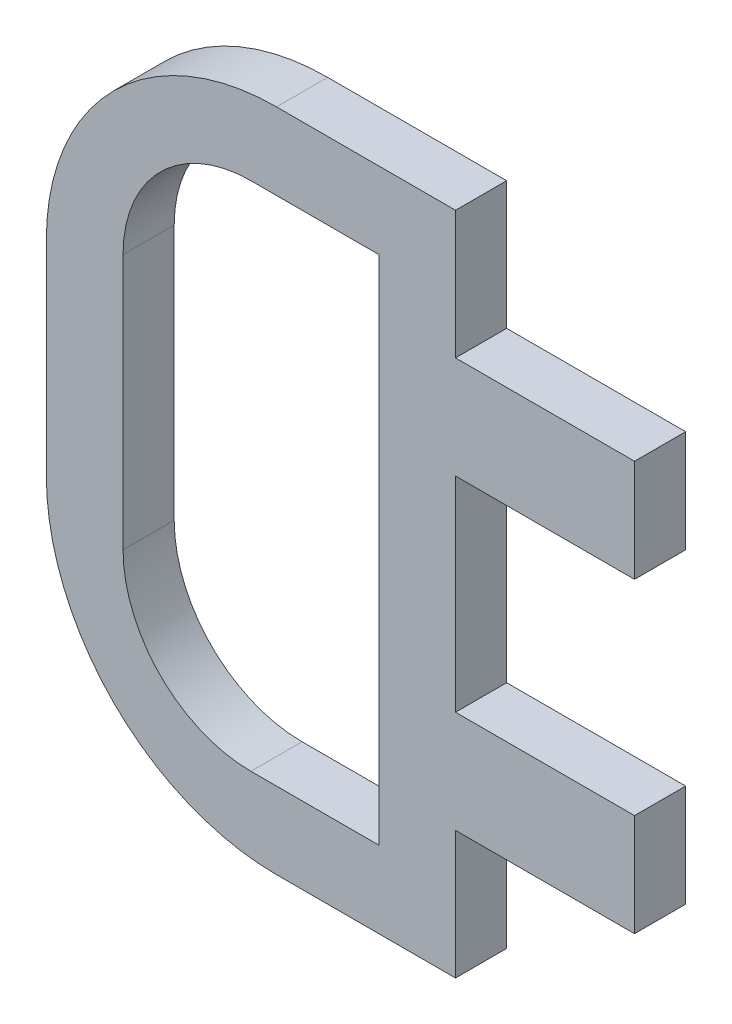
ISO-10303-21;
HEADER;
FILE_DESCRIPTION(('STEP AP214'),'2;1');
FILE_NAME('part.step','',(''),(''),'','','');
FILE_SCHEMA(('AUTOMOTIVE_DESIGN { 1 0 10303 214 1 1 1 1 }'));
ENDSEC;
DATA;
#1=APPLICATION_CONTEXT('core data for automotive mechanical design processes');
#2=APPLICATION_PROTOCOL_DEFINITION('international standard','automotive_design',2000,#1);
#3=PRODUCT_CONTEXT('',#1,'mechanical');
#4=PRODUCT('Part','Part','',(#3));
#5=PRODUCT_RELATED_PRODUCT_CATEGORY('part','',(#4));
#6=PRODUCT_DEFINITION_FORMATION('','',#4);
#7=PRODUCT_DEFINITION_CONTEXT('part definition',#1,'design');
#8=PRODUCT_DEFINITION('design','',#6,#7);
#9=PRODUCT_DEFINITION_SHAPE('','',#8);
#10=(LENGTH_UNIT() NAMED_UNIT(*) SI_UNIT(.MILLI.,.METRE.));
#11=(NAMED_UNIT(*) PLANE_ANGLE_UNIT() SI_UNIT($,.RADIAN.));
#12=(NAMED_UNIT(*) SI_UNIT($,.STERADIAN.) SOLID_ANGLE_UNIT());
#13=UNCERTAINTY_MEASURE_WITH_UNIT(LENGTH_MEASURE(1.E-05),#10,'distance_accuracy_value','');
#14=(GEOMETRIC_REPRESENTATION_CONTEXT(3) GLOBAL_UNCERTAINTY_ASSIGNED_CONTEXT((#13)) GLOBAL_UNIT_ASSIGNED_CONTEXT((#10,
#11,#12)) REPRESENTATION_CONTEXT('',''));
#15=CARTESIAN_POINT('',(0.,0.,0.));
#16=DIRECTION('',(0.,0.,1.));
#17=DIRECTION('',(1.,0.,0.));
#18=AXIS2_PLACEMENT_3D('',#15,#16,#17);
#19=CARTESIAN_POINT('',(40.,65.,10.));
#20=DIRECTION('',(-1.,0.,0.));
#21=DIRECTION('',(0.,-1.,0.));
#22=AXIS2_PLACEMENT_3D('',#19,#20,#21);
#23=PLANE('',#22);
#24=DIRECTION('',(0.,1.,0.));
#25=VECTOR('',#24,1.);
#26=CARTESIAN_POINT('',(40.,65.,10.));
#27=LINE('',#26,#25);
#28=CARTESIAN_POINT('',(40.,-20.,10.));
#29=VERTEX_POINT('',#28);
#30=CARTESIAN_POINT('',(40.,20.,10.));
#31=VERTEX_POINT('',#30);
#32=EDGE_CURVE('E39',#29,#31,#27,.T.);
#33=ORIENTED_EDGE('',*,*,#32,.F.);
#34=DIRECTION('',(0.,0.,1.));
#35=VECTOR('',#34,1.);
#36=CARTESIAN_POINT('',(40.,-20.,0.));
#37=LINE('',#36,#35);
#38=CARTESIAN_POINT('',(40.,-20.,0.));
#39=VERTEX_POINT('',#38);
#40=EDGE_CURVE('E268',#39,#29,#37,.T.);
#41=ORIENTED_EDGE('',*,*,#40,.F.);
#42=DIRECTION('',(0.,1.,0.));
#43=VECTOR('',#42,1.);
#44=CARTESIAN_POINT('',(40.,65.,0.));
#45=LINE('',#44,#43);
#46=CARTESIAN_POINT('',(40.,20.,0.));
#47=VERTEX_POINT('',#46);
#48=EDGE_CURVE('E203',#39,#47,#45,.T.);
#49=ORIENTED_EDGE('',*,*,#48,.T.);
#50=DIRECTION('',(0.,0.,1.));
#51=VECTOR('',#50,1.);
#52=CARTESIAN_POINT('',(40.,20.,0.));
#53=LINE('',#52,#51);
#54=EDGE_CURVE('E231',#47,#31,#53,.T.);
#55=ORIENTED_EDGE('',*,*,#54,.T.);
#56=EDGE_LOOP('',(#33,#41,#49,#55));
#57=FACE_BOUND('',#56,.T.);
#58=ADVANCED_FACE('F35',(#57),#23,.F.);
#59=DIRECTION('',(0.,0.,1.));
#60=VECTOR('',#59,1.);
#61=CARTESIAN_POINT('',(40.,40.,0.));
#62=LINE('',#61,#60);
#63=CARTESIAN_POINT('',(40.,40.,0.));
#64=VERTEX_POINT('',#63);
#65=CARTESIAN_POINT('',(40.,40.,10.));
#66=VERTEX_POINT('',#65);
#67=EDGE_CURVE('E233',#64,#66,#62,.T.);
#68=ORIENTED_EDGE('',*,*,#67,.F.);
#69=CARTESIAN_POINT('',(40.,65.,0.));
#70=VERTEX_POINT('',#69);
#71=EDGE_CURVE('E207',#64,#70,#45,.T.);
#72=ORIENTED_EDGE('',*,*,#71,.T.);
#73=DIRECTION('',(0.,0.,-1.));
#74=VECTOR('',#73,1.);
#75=CARTESIAN_POINT('',(40.,65.,10.));
#76=LINE('',#75,#74);
#77=CARTESIAN_POINT('',(40.,65.,10.));
#78=VERTEX_POINT('',#77);
#79=EDGE_CURVE('E11',#78,#70,#76,.T.);
#80=ORIENTED_EDGE('',*,*,#79,.F.);
#81=EDGE_CURVE('E285',#66,#78,#27,.T.);
#82=ORIENTED_EDGE('',*,*,#81,.F.);
#83=EDGE_LOOP('',(#68,#72,#80,#82));
#84=FACE_BOUND('',#83,.T.);
#85=ADVANCED_FACE('F341',(#84),#23,.F.);
#86=CARTESIAN_POINT('',(5.,-20.,10.));
#87=DIRECTION('',(0.,0.,1.));
#88=DIRECTION('',(1.,0.,0.));
#89=AXIS2_PLACEMENT_3D('',#86,#87,#88);
#90=PLANE('',#89);
#91=CARTESIAN_POINT('',(40.,-65.,10.));
#92=VERTEX_POINT('',#91);
#93=CARTESIAN_POINT('',(40.,-40.,10.));
#94=VERTEX_POINT('',#93);
#95=EDGE_CURVE('E284',#92,#94,#27,.T.);
#96=ORIENTED_EDGE('',*,*,#95,.T.);
#97=DIRECTION('',(1.,0.,0.));
#98=VECTOR('',#97,1.);
#99=CARTESIAN_POINT('',(40.,-40.,10.));
#100=LINE('',#99,#98);
#101=CARTESIAN_POINT('',(75.,-40.,10.));
#102=VERTEX_POINT('',#101);
#103=EDGE_CURVE('E180',#94,#102,#100,.T.);
#104=ORIENTED_EDGE('',*,*,#103,.T.);
#105=DIRECTION('',(0.,1.,0.));
#106=VECTOR('',#105,1.);
#107=CARTESIAN_POINT('',(75.,-20.,10.));
#108=LINE('',#107,#106);
#109=CARTESIAN_POINT('',(75.,-20.,10.));
#110=VERTEX_POINT('',#109);
#111=EDGE_CURVE('E272',#102,#110,#108,.T.);
#112=ORIENTED_EDGE('',*,*,#111,.T.);
#113=DIRECTION('',(-1.,0.,0.));
#114=VECTOR('',#113,1.);
#115=CARTESIAN_POINT('',(40.,-20.,10.));
#116=LINE('',#115,#114);
#117=EDGE_CURVE('E53',#110,#29,#116,.T.);
#118=ORIENTED_EDGE('',*,*,#117,.T.);
#119=ORIENTED_EDGE('',*,*,#32,.T.);
#120=DIRECTION('',(1.,0.,0.));
#121=VECTOR('',#120,1.);
#122=CARTESIAN_POINT('',(40.,20.,10.));
#123=LINE('',#122,#121);
#124=CARTESIAN_POINT('',(75.,20.,10.));
#125=VERTEX_POINT('',#124);
#126=EDGE_CURVE('E270',#31,#125,#123,.T.);
#127=ORIENTED_EDGE('',*,*,#126,.T.);
#128=DIRECTION('',(0.,1.,0.));
#129=VECTOR('',#128,1.);
#130=CARTESIAN_POINT('',(75.,40.,10.));
#131=LINE('',#130,#129);
#132=CARTESIAN_POINT('',(75.,40.,10.));
#133=VERTEX_POINT('',#132);
#134=EDGE_CURVE('E226',#125,#133,#131,.T.);
#135=ORIENTED_EDGE('',*,*,#134,.T.);
#136=DIRECTION('',(-1.,0.,0.));
#137=VECTOR('',#136,1.);
#138=CARTESIAN_POINT('',(40.,40.,10.));
#139=LINE('',#138,#137);
#140=EDGE_CURVE('E222',#133,#66,#139,.T.);
#141=ORIENTED_EDGE('',*,*,#140,.T.);
#142=ORIENTED_EDGE('',*,*,#81,.T.);
#143=DIRECTION('',(-1.,0.,0.));
#144=VECTOR('',#143,1.);
#145=CARTESIAN_POINT('',(5.,65.,10.));
#146=LINE('',#145,#144);
#147=CARTESIAN_POINT('',(5.,65.,10.));
#148=VERTEX_POINT('',#147);
#149=EDGE_CURVE('E286',#78,#148,#146,.T.);
#150=ORIENTED_EDGE('',*,*,#149,.T.);
#151=CARTESIAN_POINT('',(5.,20.,10.));
#152=DIRECTION('',(0.,0.,1.));
#153=DIRECTION('',(1.,0.,0.));
#154=AXIS2_PLACEMENT_3D('',#151,#152,#153);
#155=CIRCLE('',#154,45.);
#156=CARTESIAN_POINT('',(-40.,20.,10.));
#157=VERTEX_POINT('',#156);
#158=EDGE_CURVE('E301',#148,#157,#155,.T.);
#159=ORIENTED_EDGE('',*,*,#158,.T.);
#160=DIRECTION('',(0.,-1.,0.));
#161=VECTOR('',#160,1.);
#162=CARTESIAN_POINT('',(-40.,20.,10.));
#163=LINE('',#162,#161);
#164=CARTESIAN_POINT('',(-40.,-20.,10.));
#165=VERTEX_POINT('',#164);
#166=EDGE_CURVE('E303',#157,#165,#163,.T.);
#167=ORIENTED_EDGE('',*,*,#166,.T.);
#168=CARTESIAN_POINT('',(5.,-20.,10.));
#169=DIRECTION('',(0.,0.,1.));
#170=DIRECTION('',(1.,0.,0.));
#171=AXIS2_PLACEMENT_3D('',#168,#169,#170);
#172=CIRCLE('',#171,45.);
#173=CARTESIAN_POINT('',(5.,-65.,10.));
#174=VERTEX_POINT('',#173);
#175=EDGE_CURVE('E304',#165,#174,#172,.T.);
#176=ORIENTED_EDGE('',*,*,#175,.T.);
#177=DIRECTION('',(1.,0.,0.));
#178=VECTOR('',#177,1.);
#179=CARTESIAN_POINT('',(5.,-65.,10.));
#180=LINE('',#179,#178);
#181=EDGE_CURVE('E214',#174,#92,#180,.T.);
#182=ORIENTED_EDGE('',*,*,#181,.T.);
#183=EDGE_LOOP('',(#96,#104,#112,#118,#119,#127,#135,#141,#142,#150,#159,#167,#176,#182));
#184=FACE_BOUND('',#183,.T.);
#185=DIRECTION('',(-1.,0.,0.));
#186=VECTOR('',#185,1.);
#187=CARTESIAN_POINT('',(0.,50.,10.));
#188=LINE('',#187,#186);
#189=CARTESIAN_POINT('',(25.,50.,10.));
#190=VERTEX_POINT('',#189);
#191=CARTESIAN_POINT('',(0.,50.,10.));
#192=VERTEX_POINT('',#191);
#193=EDGE_CURVE('E346',#190,#192,#188,.T.);
#194=ORIENTED_EDGE('',*,*,#193,.F.);
#195=DIRECTION('',(0.,1.,0.));
#196=VECTOR('',#195,1.);
#197=CARTESIAN_POINT('',(25.,50.,10.));
#198=LINE('',#197,#196);
#199=CARTESIAN_POINT('',(25.,-50.,10.));
#200=VERTEX_POINT('',#199);
#201=EDGE_CURVE('E249',#200,#190,#198,.T.);
#202=ORIENTED_EDGE('',*,*,#201,.F.);
#203=DIRECTION('',(1.,0.,0.));
#204=VECTOR('',#203,1.);
#205=CARTESIAN_POINT('',(0.,-50.,10.));
#206=LINE('',#205,#204);
#207=CARTESIAN_POINT('',(0.,-50.,10.));
#208=VERTEX_POINT('',#207);
#209=EDGE_CURVE('E361',#208,#200,#206,.T.);
#210=ORIENTED_EDGE('',*,*,#209,.F.);
#211=CARTESIAN_POINT('',(0.,-25.,10.));
#212=DIRECTION('',(0.,0.,1.));
#213=DIRECTION('',(1.,0.,0.));
#214=AXIS2_PLACEMENT_3D('',#211,#212,#213);
#215=CIRCLE('',#214,25.);
#216=CARTESIAN_POINT('',(-25.,-25.,10.));
#217=VERTEX_POINT('',#216);
#218=EDGE_CURVE('E358',#217,#208,#215,.T.);
#219=ORIENTED_EDGE('',*,*,#218,.F.);
#220=DIRECTION('',(0.,-1.,0.));
#221=VECTOR('',#220,1.);
#222=CARTESIAN_POINT('',(-25.,25.,10.));
#223=LINE('',#222,#221);
#224=CARTESIAN_POINT('',(-25.,25.,10.));
#225=VERTEX_POINT('',#224);
#226=EDGE_CURVE('E353',#225,#217,#223,.T.);
#227=ORIENTED_EDGE('',*,*,#226,.F.);
#228=CARTESIAN_POINT('',(0.,25.,10.));
#229=DIRECTION('',(0.,0.,1.));
#230=DIRECTION('',(1.,0.,0.));
#231=AXIS2_PLACEMENT_3D('',#228,#229,#230);
#232=CIRCLE('',#231,25.);
#233=EDGE_CURVE('E349',#192,#225,#232,.T.);
#234=ORIENTED_EDGE('',*,*,#233,.F.);
#235=EDGE_LOOP('',(#194,#202,#210,#219,#227,#234));
#236=FACE_BOUND('',#235,.T.);
#237=ADVANCED_FACE('F338',(#184,#236),#90,.T.);
#238=CARTESIAN_POINT('',(5.,-20.,0.));
#239=DIRECTION('',(0.,0.,1.));
#240=DIRECTION('',(1.,0.,0.));
#241=AXIS2_PLACEMENT_3D('',#238,#239,#240);
#242=PLANE('',#241);
#243=CARTESIAN_POINT('',(40.,-65.,0.));
#244=VERTEX_POINT('',#243);
#245=CARTESIAN_POINT('',(40.,-40.,0.));
#246=VERTEX_POINT('',#245);
#247=EDGE_CURVE('E194',#244,#246,#45,.T.);
#248=ORIENTED_EDGE('',*,*,#247,.F.);
#249=DIRECTION('',(1.,0.,0.));
#250=VECTOR('',#249,1.);
#251=CARTESIAN_POINT('',(5.,-65.,0.));
#252=LINE('',#251,#250);
#253=CARTESIAN_POINT('',(5.,-65.,0.));
#254=VERTEX_POINT('',#253);
#255=EDGE_CURVE('E287',#254,#244,#252,.T.);
#256=ORIENTED_EDGE('',*,*,#255,.F.);
#257=CARTESIAN_POINT('',(5.,-20.,0.));
#258=DIRECTION('',(0.,0.,1.));
#259=DIRECTION('',(1.,0.,0.));
#260=AXIS2_PLACEMENT_3D('',#257,#258,#259);
#261=CIRCLE('',#260,45.);
#262=CARTESIAN_POINT('',(-40.,-20.,0.));
#263=VERTEX_POINT('',#262);
#264=EDGE_CURVE('E291',#263,#254,#261,.T.);
#265=ORIENTED_EDGE('',*,*,#264,.F.);
#266=DIRECTION('',(0.,-1.,0.));
#267=VECTOR('',#266,1.);
#268=CARTESIAN_POINT('',(-40.,20.,0.));
#269=LINE('',#268,#267);
#270=CARTESIAN_POINT('',(-40.,20.,0.));
#271=VERTEX_POINT('',#270);
#272=EDGE_CURVE('E331',#271,#263,#269,.T.);
#273=ORIENTED_EDGE('',*,*,#272,.F.);
#274=CARTESIAN_POINT('',(5.,20.,0.));
#275=DIRECTION('',(0.,0.,1.));
#276=DIRECTION('',(1.,0.,0.));
#277=AXIS2_PLACEMENT_3D('',#274,#275,#276);
#278=CIRCLE('',#277,45.);
#279=CARTESIAN_POINT('',(5.,65.,0.));
#280=VERTEX_POINT('',#279);
#281=EDGE_CURVE('E205',#280,#271,#278,.T.);
#282=ORIENTED_EDGE('',*,*,#281,.F.);
#283=DIRECTION('',(-1.,0.,0.));
#284=VECTOR('',#283,1.);
#285=CARTESIAN_POINT('',(5.,65.,0.));
#286=LINE('',#285,#284);
#287=EDGE_CURVE('E202',#70,#280,#286,.T.);
#288=ORIENTED_EDGE('',*,*,#287,.F.);
#289=ORIENTED_EDGE('',*,*,#71,.F.);
#290=DIRECTION('',(-1.,0.,0.));
#291=VECTOR('',#290,1.);
#292=CARTESIAN_POINT('',(40.,40.,0.));
#293=LINE('',#292,#291);
#294=CARTESIAN_POINT('',(75.,40.,0.));
#295=VERTEX_POINT('',#294);
#296=EDGE_CURVE('E229',#295,#64,#293,.T.);
#297=ORIENTED_EDGE('',*,*,#296,.F.);
#298=DIRECTION('',(0.,1.,0.));
#299=VECTOR('',#298,1.);
#300=CARTESIAN_POINT('',(75.,40.,0.));
#301=LINE('',#300,#299);
#302=CARTESIAN_POINT('',(75.,20.,0.));
#303=VERTEX_POINT('',#302);
#304=EDGE_CURVE('E232',#303,#295,#301,.T.);
#305=ORIENTED_EDGE('',*,*,#304,.F.);
#306=DIRECTION('',(1.,0.,0.));
#307=VECTOR('',#306,1.);
#308=CARTESIAN_POINT('',(40.,20.,0.));
#309=LINE('',#308,#307);
#310=EDGE_CURVE('E225',#47,#303,#309,.T.);
#311=ORIENTED_EDGE('',*,*,#310,.F.);
#312=ORIENTED_EDGE('',*,*,#48,.F.);
#313=DIRECTION('',(-1.,0.,0.));
#314=VECTOR('',#313,1.);
#315=CARTESIAN_POINT('',(40.,-20.,0.));
#316=LINE('',#315,#314);
#317=CARTESIAN_POINT('',(75.,-20.,0.));
#318=VERTEX_POINT('',#317);
#319=EDGE_CURVE('E186',#318,#39,#316,.T.);
#320=ORIENTED_EDGE('',*,*,#319,.F.);
#321=DIRECTION('',(0.,1.,0.));
#322=VECTOR('',#321,1.);
#323=CARTESIAN_POINT('',(75.,-20.,0.));
#324=LINE('',#323,#322);
#325=CARTESIAN_POINT('',(75.,-40.,0.));
#326=VERTEX_POINT('',#325);
#327=EDGE_CURVE('E197',#326,#318,#324,.T.);
#328=ORIENTED_EDGE('',*,*,#327,.F.);
#329=DIRECTION('',(1.,0.,0.));
#330=VECTOR('',#329,1.);
#331=CARTESIAN_POINT('',(40.,-40.,0.));
#332=LINE('',#331,#330);
#333=EDGE_CURVE('E178',#246,#326,#332,.T.);
#334=ORIENTED_EDGE('',*,*,#333,.F.);
#335=EDGE_LOOP('',(#248,#256,#265,#273,#282,#288,#289,#297,#305,#311,#312,#320,#328,#334));
#336=FACE_BOUND('',#335,.T.);
#337=DIRECTION('',(0.,1.,0.));
#338=VECTOR('',#337,1.);
#339=CARTESIAN_POINT('',(25.,50.,0.));
#340=LINE('',#339,#338);
#341=CARTESIAN_POINT('',(25.,-50.,0.));
#342=VERTEX_POINT('',#341);
#343=CARTESIAN_POINT('',(25.,50.,0.));
#344=VERTEX_POINT('',#343);
#345=EDGE_CURVE('E236',#342,#344,#340,.T.);
#346=ORIENTED_EDGE('',*,*,#345,.T.);
#347=DIRECTION('',(-1.,0.,0.));
#348=VECTOR('',#347,1.);
#349=CARTESIAN_POINT('',(0.,50.,0.));
#350=LINE('',#349,#348);
#351=CARTESIAN_POINT('',(0.,50.,0.));
#352=VERTEX_POINT('',#351);
#353=EDGE_CURVE('E366',#344,#352,#350,.T.);
#354=ORIENTED_EDGE('',*,*,#353,.T.);
#355=CARTESIAN_POINT('',(0.,25.,0.));
#356=DIRECTION('',(0.,0.,1.));
#357=DIRECTION('',(1.,0.,0.));
#358=AXIS2_PLACEMENT_3D('',#355,#356,#357);
#359=CIRCLE('',#358,25.);
#360=CARTESIAN_POINT('',(-25.,25.,0.));
#361=VERTEX_POINT('',#360);
#362=EDGE_CURVE('E369',#352,#361,#359,.T.);
#363=ORIENTED_EDGE('',*,*,#362,.T.);
#364=DIRECTION('',(0.,-1.,0.));
#365=VECTOR('',#364,1.);
#366=CARTESIAN_POINT('',(-25.,25.,0.));
#367=LINE('',#366,#365);
#368=CARTESIAN_POINT('',(-25.,-25.,0.));
#369=VERTEX_POINT('',#368);
#370=EDGE_CURVE('E372',#361,#369,#367,.T.);
#371=ORIENTED_EDGE('',*,*,#370,.T.);
#372=CARTESIAN_POINT('',(0.,-25.,0.));
#373=DIRECTION('',(0.,0.,1.));
#374=DIRECTION('',(1.,0.,0.));
#375=AXIS2_PLACEMENT_3D('',#372,#373,#374);
#376=CIRCLE('',#375,25.);
#377=CARTESIAN_POINT('',(0.,-50.,0.));
#378=VERTEX_POINT('',#377);
#379=EDGE_CURVE('E375',#369,#378,#376,.T.);
#380=ORIENTED_EDGE('',*,*,#379,.T.);
#381=DIRECTION('',(1.,0.,0.));
#382=VECTOR('',#381,1.);
#383=CARTESIAN_POINT('',(0.,-50.,0.));
#384=LINE('',#383,#382);
#385=EDGE_CURVE('E355',#378,#342,#384,.T.);
#386=ORIENTED_EDGE('',*,*,#385,.T.);
#387=EDGE_LOOP('',(#346,#354,#363,#371,#380,#386));
#388=FACE_BOUND('',#387,.T.);
#389=ADVANCED_FACE('F191',(#336,#388),#242,.F.);
#390=ORIENTED_EDGE('',*,*,#247,.T.);
#391=DIRECTION('',(0.,0.,1.));
#392=VECTOR('',#391,1.);
#393=CARTESIAN_POINT('',(40.,-40.,0.));
#394=LINE('',#393,#392);
#395=EDGE_CURVE('E175',#246,#94,#394,.T.);
#396=ORIENTED_EDGE('',*,*,#395,.T.);
#397=ORIENTED_EDGE('',*,*,#95,.F.);
#398=DIRECTION('',(0.,0.,-1.));
#399=VECTOR('',#398,1.);
#400=CARTESIAN_POINT('',(40.,-65.,10.));
#401=LINE('',#400,#399);
#402=EDGE_CURVE('E201',#92,#244,#401,.T.);
#403=ORIENTED_EDGE('',*,*,#402,.T.);
#404=EDGE_LOOP('',(#390,#396,#397,#403));
#405=FACE_BOUND('',#404,.T.);
#406=ADVANCED_FACE('F37',(#405),#23,.F.);
#407=CARTESIAN_POINT('',(5.,65.,10.));
#408=DIRECTION('',(0.,-1.,0.));
#409=DIRECTION('',(1.,0.,0.));
#410=AXIS2_PLACEMENT_3D('',#407,#408,#409);
#411=PLANE('',#410);
#412=ORIENTED_EDGE('',*,*,#287,.T.);
#413=DIRECTION('',(0.,0.,-1.));
#414=VECTOR('',#413,1.);
#415=CARTESIAN_POINT('',(5.,65.,10.));
#416=LINE('',#415,#414);
#417=EDGE_CURVE('E45',#148,#280,#416,.T.);
#418=ORIENTED_EDGE('',*,*,#417,.F.);
#419=ORIENTED_EDGE('',*,*,#149,.F.);
#420=ORIENTED_EDGE('',*,*,#79,.T.);
#421=EDGE_LOOP('',(#412,#418,#419,#420));
#422=FACE_BOUND('',#421,.T.);
#423=ADVANCED_FACE('F415',(#422),#411,.F.);
#424=CARTESIAN_POINT('',(5.,20.,10.));
#425=DIRECTION('',(0.,0.,-1.));
#426=DIRECTION('',(-1.,0.,0.));
#427=AXIS2_PLACEMENT_3D('',#424,#425,#426);
#428=CYLINDRICAL_SURFACE('',#427,45.);
#429=ORIENTED_EDGE('',*,*,#281,.T.);
#430=DIRECTION('',(0.,0.,-1.));
#431=VECTOR('',#430,1.);
#432=CARTESIAN_POINT('',(-40.,20.,10.));
#433=LINE('',#432,#431);
#434=EDGE_CURVE('E317',#157,#271,#433,.T.);
#435=ORIENTED_EDGE('',*,*,#434,.F.);
#436=ORIENTED_EDGE('',*,*,#158,.F.);
#437=ORIENTED_EDGE('',*,*,#417,.T.);
#438=EDGE_LOOP('',(#429,#435,#436,#437));
#439=FACE_BOUND('',#438,.T.);
#440=ADVANCED_FACE('F324',(#439),#428,.T.);
#441=CARTESIAN_POINT('',(-40.,20.,10.));
#442=DIRECTION('',(1.,0.,0.));
#443=DIRECTION('',(0.,1.,0.));
#444=AXIS2_PLACEMENT_3D('',#441,#442,#443);
#445=PLANE('',#444);
#446=ORIENTED_EDGE('',*,*,#272,.T.);
#447=DIRECTION('',(0.,0.,-1.));
#448=VECTOR('',#447,1.);
#449=CARTESIAN_POINT('',(-40.,-20.,10.));
#450=LINE('',#449,#448);
#451=EDGE_CURVE('E311',#165,#263,#450,.T.);
#452=ORIENTED_EDGE('',*,*,#451,.F.);
#453=ORIENTED_EDGE('',*,*,#166,.F.);
#454=ORIENTED_EDGE('',*,*,#434,.T.);
#455=EDGE_LOOP('',(#446,#452,#453,#454));
#456=FACE_BOUND('',#455,.T.);
#457=ADVANCED_FACE('F430',(#456),#445,.F.);
#458=CARTESIAN_POINT('',(5.,-20.,10.));
#459=DIRECTION('',(0.,0.,-1.));
#460=DIRECTION('',(-1.,0.,0.));
#461=AXIS2_PLACEMENT_3D('',#458,#459,#460);
#462=CYLINDRICAL_SURFACE('',#461,45.);
#463=ORIENTED_EDGE('',*,*,#264,.T.);
#464=DIRECTION('',(0.,0.,-1.));
#465=VECTOR('',#464,1.);
#466=CARTESIAN_POINT('',(5.,-65.,10.));
#467=LINE('',#466,#465);
#468=EDGE_CURVE('E308',#174,#254,#467,.T.);
#469=ORIENTED_EDGE('',*,*,#468,.F.);
#470=ORIENTED_EDGE('',*,*,#175,.F.);
#471=ORIENTED_EDGE('',*,*,#451,.T.);
#472=EDGE_LOOP('',(#463,#469,#470,#471));
#473=FACE_BOUND('',#472,.T.);
#474=ADVANCED_FACE('F334',(#473),#462,.T.);
#475=CARTESIAN_POINT('',(5.,-65.,10.));
#476=DIRECTION('',(0.,1.,0.));
#477=DIRECTION('',(-1.,0.,0.));
#478=AXIS2_PLACEMENT_3D('',#475,#476,#477);
#479=PLANE('',#478);
#480=ORIENTED_EDGE('',*,*,#255,.T.);
#481=ORIENTED_EDGE('',*,*,#402,.F.);
#482=ORIENTED_EDGE('',*,*,#181,.F.);
#483=ORIENTED_EDGE('',*,*,#468,.T.);
#484=EDGE_LOOP('',(#480,#481,#482,#483));
#485=FACE_BOUND('',#484,.T.);
#486=ADVANCED_FACE('F337',(#485),#479,.F.);
#487=CARTESIAN_POINT('',(25.,50.,10.));
#488=DIRECTION('',(-1.,0.,0.));
#489=DIRECTION('',(0.,-1.,0.));
#490=AXIS2_PLACEMENT_3D('',#487,#488,#489);
#491=PLANE('',#490);
#492=ORIENTED_EDGE('',*,*,#345,.F.);
#493=DIRECTION('',(0.,0.,-1.));
#494=VECTOR('',#493,1.);
#495=CARTESIAN_POINT('',(25.,-50.,10.));
#496=LINE('',#495,#494);
#497=EDGE_CURVE('E363',#200,#342,#496,.T.);
#498=ORIENTED_EDGE('',*,*,#497,.F.);
#499=ORIENTED_EDGE('',*,*,#201,.T.);
#500=DIRECTION('',(0.,0.,-1.));
#501=VECTOR('',#500,1.);
#502=CARTESIAN_POINT('',(25.,50.,10.));
#503=LINE('',#502,#501);
#504=EDGE_CURVE('E296',#190,#344,#503,.T.);
#505=ORIENTED_EDGE('',*,*,#504,.T.);
#506=EDGE_LOOP('',(#492,#498,#499,#505));
#507=FACE_BOUND('',#506,.T.);
#508=ADVANCED_FACE('F427',(#507),#491,.T.);
#509=CARTESIAN_POINT('',(0.,50.,10.));
#510=DIRECTION('',(0.,-1.,0.));
#511=DIRECTION('',(0.,0.,-1.));
#512=AXIS2_PLACEMENT_3D('',#509,#510,#511);
#513=PLANE('',#512);
#514=ORIENTED_EDGE('',*,*,#353,.F.);
#515=ORIENTED_EDGE('',*,*,#504,.F.);
#516=ORIENTED_EDGE('',*,*,#193,.T.);
#517=DIRECTION('',(0.,0.,-1.));
#518=VECTOR('',#517,1.);
#519=CARTESIAN_POINT('',(0.,50.,10.));
#520=LINE('',#519,#518);
#521=EDGE_CURVE('E387',#192,#352,#520,.T.);
#522=ORIENTED_EDGE('',*,*,#521,.T.);
#523=EDGE_LOOP('',(#514,#515,#516,#522));
#524=FACE_BOUND('',#523,.T.);
#525=ADVANCED_FACE('F457',(#524),#513,.T.);
#526=CARTESIAN_POINT('',(0.,25.,10.));
#527=DIRECTION('',(0.,0.,-1.));
#528=DIRECTION('',(-1.,0.,0.));
#529=AXIS2_PLACEMENT_3D('',#526,#527,#528);
#530=CYLINDRICAL_SURFACE('',#529,25.);
#531=ORIENTED_EDGE('',*,*,#362,.F.);
#532=ORIENTED_EDGE('',*,*,#521,.F.);
#533=ORIENTED_EDGE('',*,*,#233,.T.);
#534=DIRECTION('',(0.,0.,-1.));
#535=VECTOR('',#534,1.);
#536=CARTESIAN_POINT('',(-25.,25.,10.));
#537=LINE('',#536,#535);
#538=EDGE_CURVE('E386',#225,#361,#537,.T.);
#539=ORIENTED_EDGE('',*,*,#538,.T.);
#540=EDGE_LOOP('',(#531,#532,#533,#539));
#541=FACE_BOUND('',#540,.T.);
#542=ADVANCED_FACE('F463',(#541),#530,.F.);
#543=CARTESIAN_POINT('',(-25.,25.,10.));
#544=DIRECTION('',(1.,0.,0.));
#545=DIRECTION('',(0.,1.,0.));
#546=AXIS2_PLACEMENT_3D('',#543,#544,#545);
#547=PLANE('',#546);
#548=ORIENTED_EDGE('',*,*,#370,.F.);
#549=ORIENTED_EDGE('',*,*,#538,.F.);
#550=ORIENTED_EDGE('',*,*,#226,.T.);
#551=DIRECTION('',(0.,0.,-1.));
#552=VECTOR('',#551,1.);
#553=CARTESIAN_POINT('',(-25.,-25.,10.));
#554=LINE('',#553,#552);
#555=EDGE_CURVE('E384',#217,#369,#554,.T.);
#556=ORIENTED_EDGE('',*,*,#555,.T.);
#557=EDGE_LOOP('',(#548,#549,#550,#556));
#558=FACE_BOUND('',#557,.T.);
#559=ADVANCED_FACE('F470',(#558),#547,.T.);
#560=CARTESIAN_POINT('',(0.,-25.,10.));
#561=DIRECTION('',(0.,0.,-1.));
#562=DIRECTION('',(-1.,0.,0.));
#563=AXIS2_PLACEMENT_3D('',#560,#561,#562);
#564=CYLINDRICAL_SURFACE('',#563,25.);
#565=ORIENTED_EDGE('',*,*,#379,.F.);
#566=ORIENTED_EDGE('',*,*,#555,.F.);
#567=ORIENTED_EDGE('',*,*,#218,.T.);
#568=DIRECTION('',(0.,0.,-1.));
#569=VECTOR('',#568,1.);
#570=CARTESIAN_POINT('',(0.,-50.,10.));
#571=LINE('',#570,#569);
#572=EDGE_CURVE('E382',#208,#378,#571,.T.);
#573=ORIENTED_EDGE('',*,*,#572,.T.);
#574=EDGE_LOOP('',(#565,#566,#567,#573));
#575=FACE_BOUND('',#574,.T.);
#576=ADVANCED_FACE('F478',(#575),#564,.F.);
#577=CARTESIAN_POINT('',(0.,-50.,10.));
#578=DIRECTION('',(0.,1.,0.));
#579=DIRECTION('',(0.,0.,1.));
#580=AXIS2_PLACEMENT_3D('',#577,#578,#579);
#581=PLANE('',#580);
#582=ORIENTED_EDGE('',*,*,#385,.F.);
#583=ORIENTED_EDGE('',*,*,#572,.F.);
#584=ORIENTED_EDGE('',*,*,#209,.T.);
#585=ORIENTED_EDGE('',*,*,#497,.T.);
#586=EDGE_LOOP('',(#582,#583,#584,#585));
#587=FACE_BOUND('',#586,.T.);
#588=ADVANCED_FACE('F486',(#587),#581,.T.);
#589=CARTESIAN_POINT('',(40.,40.,0.));
#590=DIRECTION('',(0.,1.,0.));
#591=DIRECTION('',(-1.,0.,0.));
#592=AXIS2_PLACEMENT_3D('',#589,#590,#591);
#593=PLANE('',#592);
#594=ORIENTED_EDGE('',*,*,#140,.F.);
#595=DIRECTION('',(0.,0.,1.));
#596=VECTOR('',#595,1.);
#597=CARTESIAN_POINT('',(75.,40.,0.));
#598=LINE('',#597,#596);
#599=EDGE_CURVE('E237',#295,#133,#598,.T.);
#600=ORIENTED_EDGE('',*,*,#599,.F.);
#601=ORIENTED_EDGE('',*,*,#296,.T.);
#602=ORIENTED_EDGE('',*,*,#67,.T.);
#603=EDGE_LOOP('',(#594,#600,#601,#602));
#604=FACE_BOUND('',#603,.T.);
#605=ADVANCED_FACE('F396',(#604),#593,.T.);
#606=CARTESIAN_POINT('',(75.,40.,0.));
#607=DIRECTION('',(1.,0.,0.));
#608=DIRECTION('',(0.,0.,-1.));
#609=AXIS2_PLACEMENT_3D('',#606,#607,#608);
#610=PLANE('',#609);
#611=ORIENTED_EDGE('',*,*,#134,.F.);
#612=DIRECTION('',(0.,0.,1.));
#613=VECTOR('',#612,1.);
#614=CARTESIAN_POINT('',(75.,20.,0.));
#615=LINE('',#614,#613);
#616=EDGE_CURVE('E245',#303,#125,#615,.T.);
#617=ORIENTED_EDGE('',*,*,#616,.F.);
#618=ORIENTED_EDGE('',*,*,#304,.T.);
#619=ORIENTED_EDGE('',*,*,#599,.T.);
#620=EDGE_LOOP('',(#611,#617,#618,#619));
#621=FACE_BOUND('',#620,.T.);
#622=ADVANCED_FACE('F399',(#621),#610,.T.);
#623=CARTESIAN_POINT('',(40.,20.,0.));
#624=DIRECTION('',(0.,-1.,0.));
#625=DIRECTION('',(0.,0.,-1.));
#626=AXIS2_PLACEMENT_3D('',#623,#624,#625);
#627=PLANE('',#626);
#628=ORIENTED_EDGE('',*,*,#126,.F.);
#629=ORIENTED_EDGE('',*,*,#54,.F.);
#630=ORIENTED_EDGE('',*,*,#310,.T.);
#631=ORIENTED_EDGE('',*,*,#616,.T.);
#632=EDGE_LOOP('',(#628,#629,#630,#631));
#633=FACE_BOUND('',#632,.T.);
#634=ADVANCED_FACE('F400',(#633),#627,.T.);
#635=CARTESIAN_POINT('',(40.,-20.,0.));
#636=DIRECTION('',(0.,1.,0.));
#637=DIRECTION('',(-1.,0.,0.));
#638=AXIS2_PLACEMENT_3D('',#635,#636,#637);
#639=PLANE('',#638);
#640=ORIENTED_EDGE('',*,*,#117,.F.);
#641=DIRECTION('',(0.,0.,1.));
#642=VECTOR('',#641,1.);
#643=CARTESIAN_POINT('',(75.,-20.,0.));
#644=LINE('',#643,#642);
#645=EDGE_CURVE('E266',#318,#110,#644,.T.);
#646=ORIENTED_EDGE('',*,*,#645,.F.);
#647=ORIENTED_EDGE('',*,*,#319,.T.);
#648=ORIENTED_EDGE('',*,*,#40,.T.);
#649=EDGE_LOOP('',(#640,#646,#647,#648));
#650=FACE_BOUND('',#649,.T.);
#651=ADVANCED_FACE('F282',(#650),#639,.T.);
#652=CARTESIAN_POINT('',(75.,-20.,0.));
#653=DIRECTION('',(1.,0.,0.));
#654=DIRECTION('',(0.,0.,-1.));
#655=AXIS2_PLACEMENT_3D('',#652,#653,#654);
#656=PLANE('',#655);
#657=ORIENTED_EDGE('',*,*,#111,.F.);
#658=DIRECTION('',(0.,0.,1.));
#659=VECTOR('',#658,1.);
#660=CARTESIAN_POINT('',(75.,-40.,0.));
#661=LINE('',#660,#659);
#662=EDGE_CURVE('E185',#326,#102,#661,.T.);
#663=ORIENTED_EDGE('',*,*,#662,.F.);
#664=ORIENTED_EDGE('',*,*,#327,.T.);
#665=ORIENTED_EDGE('',*,*,#645,.T.);
#666=EDGE_LOOP('',(#657,#663,#664,#665));
#667=FACE_BOUND('',#666,.T.);
#668=ADVANCED_FACE('F278',(#667),#656,.T.);
#669=CARTESIAN_POINT('',(40.,-40.,0.));
#670=DIRECTION('',(0.,-1.,0.));
#671=DIRECTION('',(1.,0.,0.));
#672=AXIS2_PLACEMENT_3D('',#669,#670,#671);
#673=PLANE('',#672);
#674=ORIENTED_EDGE('',*,*,#103,.F.);
#675=ORIENTED_EDGE('',*,*,#395,.F.);
#676=ORIENTED_EDGE('',*,*,#333,.T.);
#677=ORIENTED_EDGE('',*,*,#662,.T.);
#678=EDGE_LOOP('',(#674,#675,#676,#677));
#679=FACE_BOUND('',#678,.T.);
#680=ADVANCED_FACE('F177',(#679),#673,.T.);
#681=CLOSED_SHELL('',(#58,#85,#237,#389,#406,#423,#440,#457,#474,#486,#508,#525,#542,#559,#576,
#588,#605,#622,#634,#651,#668,#680));
#682=MANIFOLD_SOLID_BREP('B2',#681);
#683=ADVANCED_BREP_SHAPE_REPRESENTATION('',(#18,#682),#14);
#684=SHAPE_DEFINITION_REPRESENTATION(#9,#683);
ENDSEC;
END-ISO-10303-21;
